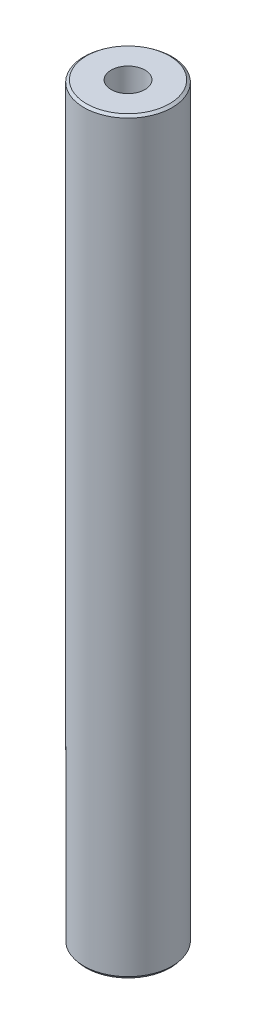
ISO-10303-21;
HEADER;
FILE_DESCRIPTION(('STEP AP214'),'2;1');
FILE_NAME('part.step','',(''),(''),'','','');
FILE_SCHEMA(('AUTOMOTIVE_DESIGN { 1 0 10303 214 1 1 1 1 }'));
ENDSEC;
DATA;
#1=APPLICATION_CONTEXT('core data for automotive mechanical design processes');
#2=APPLICATION_PROTOCOL_DEFINITION('international standard','automotive_design',2000,#1);
#3=PRODUCT_CONTEXT('',#1,'mechanical');
#4=PRODUCT('Part','Part','',(#3));
#5=PRODUCT_RELATED_PRODUCT_CATEGORY('part','',(#4));
#6=PRODUCT_DEFINITION_FORMATION('','',#4);
#7=PRODUCT_DEFINITION_CONTEXT('part definition',#1,'design');
#8=PRODUCT_DEFINITION('design','',#6,#7);
#9=PRODUCT_DEFINITION_SHAPE('','',#8);
#10=(LENGTH_UNIT() NAMED_UNIT(*) SI_UNIT(.MILLI.,.METRE.));
#11=(NAMED_UNIT(*) PLANE_ANGLE_UNIT() SI_UNIT($,.RADIAN.));
#12=(NAMED_UNIT(*) SI_UNIT($,.STERADIAN.) SOLID_ANGLE_UNIT());
#13=UNCERTAINTY_MEASURE_WITH_UNIT(LENGTH_MEASURE(1.E-05),#10,'distance_accuracy_value','');
#14=(GEOMETRIC_REPRESENTATION_CONTEXT(3) GLOBAL_UNCERTAINTY_ASSIGNED_CONTEXT((#13)) GLOBAL_UNIT_ASSIGNED_CONTEXT((#10,
#11,#12)) REPRESENTATION_CONTEXT('',''));
#15=CARTESIAN_POINT('',(0.,0.,0.));
#16=DIRECTION('',(0.,0.,1.));
#17=DIRECTION('',(1.,0.,0.));
#18=AXIS2_PLACEMENT_3D('',#15,#16,#17);
#19=CARTESIAN_POINT('',(0.,169.629749906992,0.));
#20=DIRECTION('',(0.,-1.,0.));
#21=DIRECTION('',(0.,0.,-1.));
#22=AXIS2_PLACEMENT_3D('',#19,#20,#21);
#23=CYLINDRICAL_SURFACE('',#22,10.);
#24=CARTESIAN_POINT('',(0.,169.176562320254,0.));
#25=DIRECTION('',(0.,1.,0.));
#26=DIRECTION('',(0.,0.,1.));
#27=AXIS2_PLACEMENT_3D('',#24,#25,#26);
#28=CIRCLE('',#27,10.);
#29=CARTESIAN_POINT('',(0.,169.176562320254,-10.));
#30=VERTEX_POINT('',#29);
#31=EDGE_CURVE('E50',#30,#30,#28,.F.);
#32=CARTESIAN_POINT('',(0.,0.588444118728937,0.));
#33=DIRECTION('',(0.,1.,0.));
#34=DIRECTION('',(0.,0.,1.));
#35=AXIS2_PLACEMENT_3D('',#32,#33,#34);
#36=CIRCLE('',#35,10.);
#37=CARTESIAN_POINT('',(0.,0.588444118728909,-10.));
#38=VERTEX_POINT('',#37);
#39=EDGE_CURVE('E51',#38,#38,#36,.T.);
#40=CARTESIAN_POINT('',(0.,169.176562320254,-10.));
#41=CARTESIAN_POINT('',(0.,167.420436088989,-10.));
#42=CARTESIAN_POINT('',(0.,165.664309857723,-10.));
#43=CARTESIAN_POINT('',(0.,162.152057395191,-10.));
#44=CARTESIAN_POINT('',(0.,160.395931163925,-10.));
#45=CARTESIAN_POINT('',(0.,156.883678701393,-10.));
#46=CARTESIAN_POINT('',(0.,155.127552470127,-10.));
#47=CARTESIAN_POINT('',(0.,151.615300007596,-10.));
#48=CARTESIAN_POINT('',(0.,149.85917377633,-10.));
#49=CARTESIAN_POINT('',(0.,146.346921313798,-10.));
#50=CARTESIAN_POINT('',(0.,144.590795082532,-10.));
#51=CARTESIAN_POINT('',(0.,141.07854262,-10.));
#52=CARTESIAN_POINT('',(0.,139.322416388734,-10.));
#53=CARTESIAN_POINT('',(0.,135.810163926203,-10.));
#54=CARTESIAN_POINT('',(0.,134.054037694937,-10.));
#55=CARTESIAN_POINT('',(0.,130.541785232405,-10.));
#56=CARTESIAN_POINT('',(0.,128.785659001139,-10.));
#57=CARTESIAN_POINT('',(0.,125.273406538607,-10.));
#58=CARTESIAN_POINT('',(0.,123.517280307341,-10.));
#59=CARTESIAN_POINT('',(0.,120.00502784481,-10.));
#60=CARTESIAN_POINT('',(0.,118.248901613544,-10.));
#61=CARTESIAN_POINT('',(0.,114.736649151012,-10.));
#62=CARTESIAN_POINT('',(0.,112.980522919746,-10.));
#63=CARTESIAN_POINT('',(0.,109.468270457214,-10.));
#64=CARTESIAN_POINT('',(0.,107.712144225948,-10.));
#65=CARTESIAN_POINT('',(0.,104.199891763416,-10.));
#66=CARTESIAN_POINT('',(0.,102.443765532151,-10.));
#67=CARTESIAN_POINT('',(0.,98.9315130696188,-10.));
#68=CARTESIAN_POINT('',(0.,97.1753868383529,-10.));
#69=CARTESIAN_POINT('',(0.,93.6631343758211,-10.));
#70=CARTESIAN_POINT('',(0.,91.9070081445552,-10.));
#71=CARTESIAN_POINT('',(0.,88.3947556820235,-10.));
#72=CARTESIAN_POINT('',(0.,86.6386294507576,-10.));
#73=CARTESIAN_POINT('',(0.,83.1263769882258,-10.));
#74=CARTESIAN_POINT('',(0.,81.3702507569599,-10.));
#75=CARTESIAN_POINT('',(0.,77.8579982944281,-10.));
#76=CARTESIAN_POINT('',(0.,76.1018720631622,-10.));
#77=CARTESIAN_POINT('',(0.,72.5896196006304,-10.));
#78=CARTESIAN_POINT('',(0.,70.8334933693646,-10.));
#79=CARTESIAN_POINT('',(0.,67.3212409068328,-10.));
#80=CARTESIAN_POINT('',(0.,65.5651146755669,-10.));
#81=CARTESIAN_POINT('',(0.,62.0528622130351,-10.));
#82=CARTESIAN_POINT('',(0.,60.2967359817692,-10.));
#83=CARTESIAN_POINT('',(0.,56.7844835192374,-10.));
#84=CARTESIAN_POINT('',(0.,55.0283572879715,-10.));
#85=CARTESIAN_POINT('',(0.,51.5161048254398,-10.));
#86=CARTESIAN_POINT('',(0.,49.7599785941739,-10.));
#87=CARTESIAN_POINT('',(0.,46.2477261316421,-10.));
#88=CARTESIAN_POINT('',(0.,44.4915999003762,-10.));
#89=CARTESIAN_POINT('',(0.,40.9793474378444,-10.));
#90=CARTESIAN_POINT('',(0.,39.2232212065785,-10.));
#91=CARTESIAN_POINT('',(0.,35.7109687440467,-10.));
#92=CARTESIAN_POINT('',(0.,33.9548425127808,-10.));
#93=CARTESIAN_POINT('',(0.,30.4425900502491,-10.));
#94=CARTESIAN_POINT('',(0.,28.6864638189832,-10.));
#95=CARTESIAN_POINT('',(0.,25.1742113564514,-10.));
#96=CARTESIAN_POINT('',(0.,23.4180851251855,-10.));
#97=CARTESIAN_POINT('',(0.,19.9058326626537,-10.));
#98=CARTESIAN_POINT('',(0.,18.1497064313878,-10.));
#99=CARTESIAN_POINT('',(0.,14.637453968856,-10.));
#100=CARTESIAN_POINT('',(0.,12.8813277375902,-10.));
#101=CARTESIAN_POINT('',(0.,9.36907527505837,-10.));
#102=CARTESIAN_POINT('',(0.,7.61294904379248,-10.));
#103=CARTESIAN_POINT('',(0.,4.10069658126069,-10.));
#104=CARTESIAN_POINT('',(0.,2.3445703499948,-10.));
#105=CARTESIAN_POINT('',(0.,0.588444118728909,-10.));
#106=B_SPLINE_CURVE_WITH_KNOTS('',3,(#40,#41,#42,#43,#44,#45,#46,#47,#48,#49,#50,#51,#52,#53,
#54,#55,#56,#57,#58,#59,#60,#61,#62,#63,#64,#65,#66,#67,#68,#69,#70,#71,#72,#73,#74,#75,#76,#77,
#78,#79,#80,#81,#82,#83,#84,#85,#86,#87,#88,#89,#90,#91,#92,#93,#94,#95,#96,#97,#98,#99,#100,
#101,#102,#103,#104,#105),.UNSPECIFIED.,.F.,.F.,(4,2,2,2,2,2,2,2,2,2,2,2,2,2,2,2,2,2,2,2,2,2,2,
2,2,2,2,2,2,2,2,2,4),(0.,5.26837869379765,10.5367573875953,15.805136081393,21.0735147751907,
26.3418934689884,31.610272162786,36.8786508565837,42.1470295503814,47.415408244179,
52.6837869379767,57.9521656317744,63.2205443255721,68.4889230193697,73.7573017131674,
79.0256804069651,84.2940591007628,89.5624377945604,94.8308164883581,100.099195182156,
105.367573875953,110.635952569751,115.904331263549,121.172709957346,126.441088651144,
131.709467344942,136.97784603874,142.246224732537,147.514603426335,152.782982120132,
158.05136081393,163.319739507728,168.588118201526),.UNSPECIFIED.);
#107=EDGE_CURVE('BSEAM39',#30,#38,#106,.T.);
#108=ORIENTED_EDGE('',*,*,#31,.T.);
#109=ORIENTED_EDGE('',*,*,#39,.T.);
#110=ORIENTED_EDGE('',*,*,#107,.T.);
#111=ORIENTED_EDGE('',*,*,#107,.F.);
#112=EDGE_LOOP('',(#108,#110,#109,#111));
#113=FACE_BOUND('',#112,.T.);
#114=ADVANCED_FACE('F39',(#113),#23,.T.);
#115=CARTESIAN_POINT('',(0.,169.629749906992,0.));
#116=DIRECTION('',(0.,1.,0.));
#117=DIRECTION('',(0.,0.,1.));
#118=AXIS2_PLACEMENT_3D('',#115,#116,#117);
#119=PLANE('',#118);
#120=CARTESIAN_POINT('',(0.,169.629749906992,0.));
#121=DIRECTION('',(0.,1.,0.));
#122=DIRECTION('',(0.,0.,1.));
#123=AXIS2_PLACEMENT_3D('',#120,#121,#122);
#124=CIRCLE('',#123,9.41155588127129);
#125=CARTESIAN_POINT('',(0.,169.629749906992,9.41155588127129));
#126=VERTEX_POINT('',#125);
#127=EDGE_CURVE('E54',#126,#126,#124,.T.);
#128=ORIENTED_EDGE('',*,*,#127,.T.);
#129=EDGE_LOOP('',(#128));
#130=FACE_BOUND('',#129,.T.);
#131=CARTESIAN_POINT('',(0.,169.629749906992,0.));
#132=DIRECTION('',(0.,1.,0.));
#133=DIRECTION('',(0.,0.,1.));
#134=AXIS2_PLACEMENT_3D('',#131,#132,#133);
#135=CIRCLE('',#134,3.84126759927331);
#136=CARTESIAN_POINT('',(0.,169.629749906992,-3.84126759927331));
#137=VERTEX_POINT('',#136);
#138=EDGE_CURVE('E58',#137,#137,#135,.T.);
#139=ORIENTED_EDGE('',*,*,#138,.F.);
#140=EDGE_LOOP('',(#139));
#141=FACE_BOUND('',#140,.T.);
#142=ADVANCED_FACE('F69',(#130,#141),#119,.T.);
#143=CARTESIAN_POINT('',(0.,0.,0.));
#144=DIRECTION('',(0.,1.,0.));
#145=DIRECTION('',(0.,0.,1.));
#146=AXIS2_PLACEMENT_3D('',#143,#144,#145);
#147=PLANE('',#146);
#148=CARTESIAN_POINT('',(0.,0.,0.));
#149=DIRECTION('',(0.,1.,0.));
#150=DIRECTION('',(0.,0.,1.));
#151=AXIS2_PLACEMENT_3D('',#148,#149,#150);
#152=CIRCLE('',#151,9.54681241326255);
#153=CARTESIAN_POINT('',(0.,0.,9.54681241326255));
#154=VERTEX_POINT('',#153);
#155=EDGE_CURVE('E10',#154,#154,#152,.F.);
#156=ORIENTED_EDGE('',*,*,#155,.T.);
#157=EDGE_LOOP('',(#156));
#158=FACE_BOUND('',#157,.T.);
#159=CARTESIAN_POINT('',(0.,0.,0.));
#160=DIRECTION('',(0.,1.,0.));
#161=DIRECTION('',(0.,0.,1.));
#162=AXIS2_PLACEMENT_3D('',#159,#160,#161);
#163=CIRCLE('',#162,3.84126759927331);
#164=CARTESIAN_POINT('',(0.,0.,-3.84126759927331));
#165=VERTEX_POINT('',#164);
#166=EDGE_CURVE('E63',#165,#165,#163,.T.);
#167=ORIENTED_EDGE('',*,*,#166,.T.);
#168=EDGE_LOOP('',(#167));
#169=FACE_BOUND('',#168,.T.);
#170=ADVANCED_FACE('F75',(#158,#169),#147,.F.);
#171=CARTESIAN_POINT('',(0.,169.629749906992,0.));
#172=DIRECTION('',(0.,-1.,0.));
#173=DIRECTION('',(0.,0.,-1.));
#174=AXIS2_PLACEMENT_3D('',#171,#172,#173);
#175=CYLINDRICAL_SURFACE('',#174,3.84126759927331);
#176=CARTESIAN_POINT('',(0.,169.629749906992,-3.84126759927331));
#177=CARTESIAN_POINT('',(0.,167.862773345461,-3.84126759927331));
#178=CARTESIAN_POINT('',(0.,166.095796783929,-3.84126759927331));
#179=CARTESIAN_POINT('',(0.,162.561843660867,-3.84126759927331));
#180=CARTESIAN_POINT('',(0.,160.794867099336,-3.84126759927331));
#181=CARTESIAN_POINT('',(0.,157.260913976274,-3.84126759927331));
#182=CARTESIAN_POINT('',(0.,155.493937414742,-3.84126759927331));
#183=CARTESIAN_POINT('',(0.,151.95998429168,-3.84126759927331));
#184=CARTESIAN_POINT('',(0.,150.193007730149,-3.84126759927331));
#185=CARTESIAN_POINT('',(0.,146.659054607087,-3.84126759927331));
#186=CARTESIAN_POINT('',(0.,144.892078045555,-3.84126759927331));
#187=CARTESIAN_POINT('',(0.,141.358124922493,-3.84126759927331));
#188=CARTESIAN_POINT('',(0.,139.591148360962,-3.84126759927331));
#189=CARTESIAN_POINT('',(0.,136.0571952379,-3.84126759927331));
#190=CARTESIAN_POINT('',(0.,134.290218676368,-3.84126759927331));
#191=CARTESIAN_POINT('',(0.,130.756265553306,-3.84126759927331));
#192=CARTESIAN_POINT('',(0.,128.989288991775,-3.84126759927331));
#193=CARTESIAN_POINT('',(0.,125.455335868713,-3.84126759927331));
#194=CARTESIAN_POINT('',(0.,123.688359307181,-3.84126759927331));
#195=CARTESIAN_POINT('',(0.,120.154406184119,-3.84126759927331));
#196=CARTESIAN_POINT('',(0.,118.387429622588,-3.84126759927331));
#197=CARTESIAN_POINT('',(0.,114.853476499526,-3.84126759927331));
#198=CARTESIAN_POINT('',(0.,113.086499937994,-3.84126759927331));
#199=CARTESIAN_POINT('',(0.,109.552546814932,-3.84126759927331));
#200=CARTESIAN_POINT('',(0.,107.785570253401,-3.84126759927331));
#201=CARTESIAN_POINT('',(0.,104.251617130339,-3.84126759927331));
#202=CARTESIAN_POINT('',(0.,102.484640568807,-3.84126759927331));
#203=CARTESIAN_POINT('',(0.,98.9506874457451,-3.84126759927331));
#204=CARTESIAN_POINT('',(0.,97.183710884214,-3.84126759927331));
#205=CARTESIAN_POINT('',(0.,93.6497577611517,-3.84126759927331));
#206=CARTESIAN_POINT('',(0.,91.8827811996205,-3.84126759927331));
#207=CARTESIAN_POINT('',(0.,88.3488280765582,-3.84126759927331));
#208=CARTESIAN_POINT('',(0.,86.581851515027,-3.84126759927331));
#209=CARTESIAN_POINT('',(0.,83.0478983919647,-3.84126759927331));
#210=CARTESIAN_POINT('',(0.,81.2809218304335,-3.84126759927331));
#211=CARTESIAN_POINT('',(0.,77.7469687073712,-3.84126759927331));
#212=CARTESIAN_POINT('',(0.,75.97999214584,-3.84126759927331));
#213=CARTESIAN_POINT('',(0.,72.4460390227777,-3.84126759927331));
#214=CARTESIAN_POINT('',(0.,70.6790624612465,-3.84126759927331));
#215=CARTESIAN_POINT('',(0.,67.1451093381842,-3.84126759927331));
#216=CARTESIAN_POINT('',(0.,65.378132776653,-3.84126759927331));
#217=CARTESIAN_POINT('',(0.,61.8441796535907,-3.84126759927331));
#218=CARTESIAN_POINT('',(0.,60.0772030920595,-3.84126759927331));
#219=CARTESIAN_POINT('',(0.,56.5432499689972,-3.84126759927331));
#220=CARTESIAN_POINT('',(0.,54.7762734074661,-3.84126759927331));
#221=CARTESIAN_POINT('',(0.,51.2423202844037,-3.84126759927331));
#222=CARTESIAN_POINT('',(0.,49.4753437228726,-3.84126759927331));
#223=CARTESIAN_POINT('',(0.,45.9413905998102,-3.84126759927331));
#224=CARTESIAN_POINT('',(0.,44.1744140382791,-3.84126759927331));
#225=CARTESIAN_POINT('',(0.,40.6404609152167,-3.84126759927331));
#226=CARTESIAN_POINT('',(0.,38.8734843536856,-3.84126759927331));
#227=CARTESIAN_POINT('',(0.,35.3395312306233,-3.84126759927331));
#228=CARTESIAN_POINT('',(0.,33.5725546690921,-3.84126759927331));
#229=CARTESIAN_POINT('',(0.,30.0386015460298,-3.84126759927331));
#230=CARTESIAN_POINT('',(0.,28.2716249844986,-3.84126759927331));
#231=CARTESIAN_POINT('',(0.,24.7376718614363,-3.84126759927331));
#232=CARTESIAN_POINT('',(0.,22.9706952999051,-3.84126759927331));
#233=CARTESIAN_POINT('',(0.,19.4367421768428,-3.84126759927331));
#234=CARTESIAN_POINT('',(0.,17.6697656153116,-3.84126759927331));
#235=CARTESIAN_POINT('',(0.,14.1358124922493,-3.84126759927331));
#236=CARTESIAN_POINT('',(0.,12.3688359307181,-3.84126759927331));
#237=CARTESIAN_POINT('',(0.,8.83488280765579,-3.84126759927331));
#238=CARTESIAN_POINT('',(0.,7.06790624612463,-3.84126759927331));
#239=CARTESIAN_POINT('',(0.,3.53395312306231,-3.84126759927331));
#240=CARTESIAN_POINT('',(0.,1.76697656153114,-3.84126759927331));
#241=CARTESIAN_POINT('',(0.,0.,-3.84126759927331));
#242=B_SPLINE_CURVE_WITH_KNOTS('',3,(#176,#177,#178,#179,#180,#181,#182,#183,#184,#185,#186,
#187,#188,#189,#190,#191,#192,#193,#194,#195,#196,#197,#198,#199,#200,#201,#202,#203,#204,#205,
#206,#207,#208,#209,#210,#211,#212,#213,#214,#215,#216,#217,#218,#219,#220,#221,#222,#223,#224,
#225,#226,#227,#228,#229,#230,#231,#232,#233,#234,#235,#236,#237,#238,#239,#240,#241),
.UNSPECIFIED.,.F.,.F.,(4,2,2,2,2,2,2,2,2,2,2,2,2,2,2,2,2,2,2,2,2,2,2,2,2,2,2,2,2,2,2,2,4),(0.,
5.30092968459348,10.601859369187,15.9027890537805,21.203718738374,26.5046484229674,
31.8055781075609,37.1065077921544,42.4074374767479,47.7083671613414,53.0092968459349,
58.3102265305284,63.6111562151219,68.9120858997154,74.2130155843089,79.5139452689023,
84.8148749534958,90.1158046380893,95.4167343226828,100.717664007276,106.01859369187,
111.319523376463,116.620453061057,121.92138274565,127.222312430244,132.523242114837,
137.824171799431,143.125101484024,148.426031168618,153.726960853211,159.027890537805,
164.328820222398,169.629749906992),.UNSPECIFIED.);
#243=EDGE_CURVE('BSEAM70',#137,#165,#242,.T.);
#244=ORIENTED_EDGE('',*,*,#138,.T.);
#245=ORIENTED_EDGE('',*,*,#166,.F.);
#246=ORIENTED_EDGE('',*,*,#243,.T.);
#247=ORIENTED_EDGE('',*,*,#243,.F.);
#248=EDGE_LOOP('',(#244,#246,#245,#247));
#249=FACE_BOUND('',#248,.T.);
#250=ADVANCED_FACE('F70',(#249),#175,.F.);
#251=CARTESIAN_POINT('',(0.,169.629749906992,0.));
#252=DIRECTION('',(0.,-1.,0.));
#253=DIRECTION('',(0.,0.,-1.));
#254=AXIS2_PLACEMENT_3D('',#251,#252,#253);
#255=CONICAL_SURFACE('',#254,9.41155588127129,0.914526275917471);
#256=ORIENTED_EDGE('',*,*,#31,.F.);
#257=EDGE_LOOP('',(#256));
#258=FACE_BOUND('',#257,.T.);
#259=ORIENTED_EDGE('',*,*,#127,.F.);
#260=EDGE_LOOP('',(#259));
#261=FACE_BOUND('',#260,.T.);
#262=ADVANCED_FACE('F81',(#258,#261),#255,.T.);
#263=CARTESIAN_POINT('',(0.,0.588444118728937,0.));
#264=DIRECTION('',(0.,1.,0.));
#265=DIRECTION('',(0.,0.,1.));
#266=AXIS2_PLACEMENT_3D('',#263,#264,#265);
#267=CONICAL_SURFACE('',#266,10.,0.656270050877467);
#268=ORIENTED_EDGE('',*,*,#155,.F.);
#269=EDGE_LOOP('',(#268));
#270=FACE_BOUND('',#269,.T.);
#271=ORIENTED_EDGE('',*,*,#39,.F.);
#272=EDGE_LOOP('',(#271));
#273=FACE_BOUND('',#272,.T.);
#274=ADVANCED_FACE('F45',(#270,#273),#267,.T.);
#275=CLOSED_SHELL('',(#114,#142,#170,#250,#262,#274));
#276=MANIFOLD_SOLID_BREP('B2',#275);
#277=ADVANCED_BREP_SHAPE_REPRESENTATION('',(#18,#276),#14);
#278=SHAPE_DEFINITION_REPRESENTATION(#9,#277);
ENDSEC;
END-ISO-10303-21;
